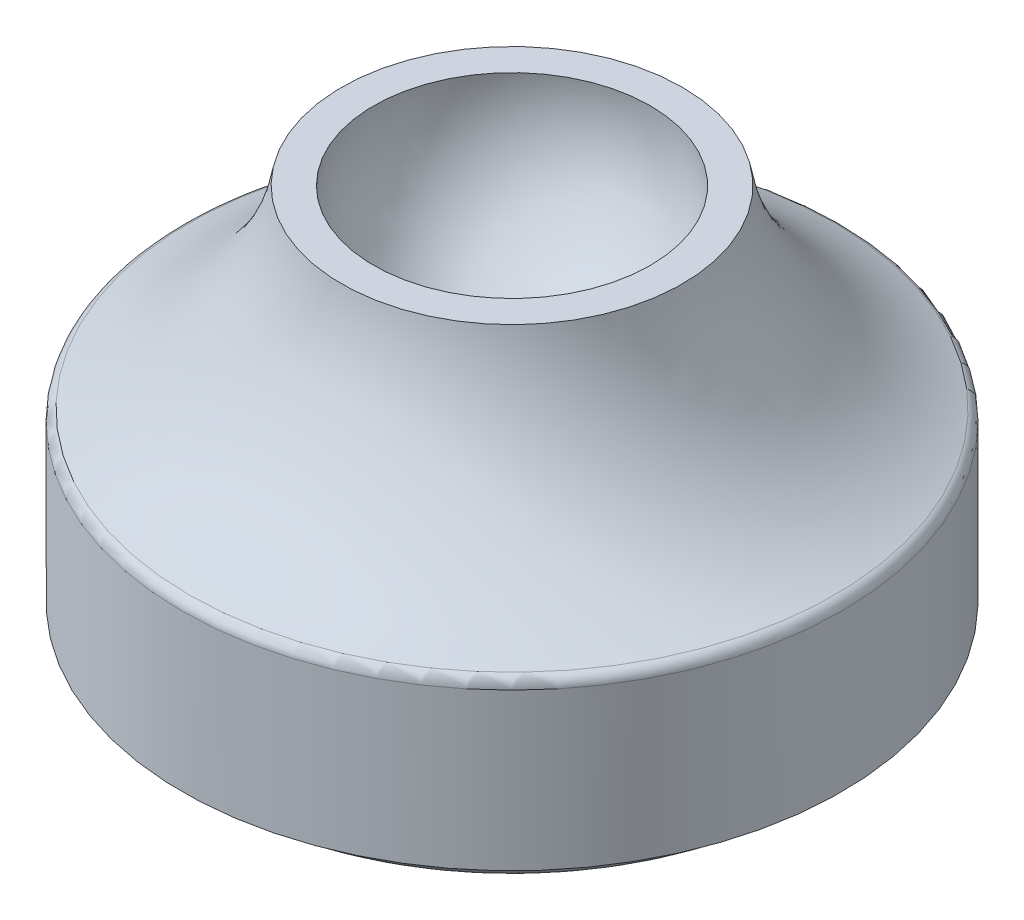
ISO-10303-21;
HEADER;
FILE_DESCRIPTION(('STEP AP214'),'2;1');
FILE_NAME('part.step','',(''),(''),'','','');
FILE_SCHEMA(('AUTOMOTIVE_DESIGN { 1 0 10303 214 1 1 1 1 }'));
ENDSEC;
DATA;
#1=APPLICATION_CONTEXT('core data for automotive mechanical design processes');
#2=APPLICATION_PROTOCOL_DEFINITION('international standard','automotive_design',2000,#1);
#3=PRODUCT_CONTEXT('',#1,'mechanical');
#4=PRODUCT('Part','Part','',(#3));
#5=PRODUCT_RELATED_PRODUCT_CATEGORY('part','',(#4));
#6=PRODUCT_DEFINITION_FORMATION('','',#4);
#7=PRODUCT_DEFINITION_CONTEXT('part definition',#1,'design');
#8=PRODUCT_DEFINITION('design','',#6,#7);
#9=PRODUCT_DEFINITION_SHAPE('','',#8);
#10=(LENGTH_UNIT() NAMED_UNIT(*) SI_UNIT(.MILLI.,.METRE.));
#11=(NAMED_UNIT(*) PLANE_ANGLE_UNIT() SI_UNIT($,.RADIAN.));
#12=(NAMED_UNIT(*) SI_UNIT($,.STERADIAN.) SOLID_ANGLE_UNIT());
#13=UNCERTAINTY_MEASURE_WITH_UNIT(LENGTH_MEASURE(1.E-05),#10,'distance_accuracy_value','');
#14=(GEOMETRIC_REPRESENTATION_CONTEXT(3) GLOBAL_UNCERTAINTY_ASSIGNED_CONTEXT((#13)) GLOBAL_UNIT_ASSIGNED_CONTEXT((#10,
#11,#12)) REPRESENTATION_CONTEXT('',''));
#15=CARTESIAN_POINT('',(0.,0.,0.));
#16=DIRECTION('',(0.,0.,1.));
#17=DIRECTION('',(1.,0.,0.));
#18=AXIS2_PLACEMENT_3D('',#15,#16,#17);
#19=CARTESIAN_POINT('',(0.,0.,0.));
#20=DIRECTION('',(0.,-1.,0.));
#21=DIRECTION('',(0.,0.,-1.));
#22=AXIS2_PLACEMENT_3D('',#19,#20,#21);
#23=PLANE('',#22);
#24=CARTESIAN_POINT('',(0.,0.,0.));
#25=DIRECTION('',(0.,-1.,0.));
#26=DIRECTION('',(0.,0.,-1.));
#27=AXIS2_PLACEMENT_3D('',#24,#25,#26);
#28=CIRCLE('',#27,25.2861999120616);
#29=CARTESIAN_POINT('',(0.,0.,-25.2861999120616));
#30=VERTEX_POINT('',#29);
#31=EDGE_CURVE('E48',#30,#30,#28,.T.);
#32=ORIENTED_EDGE('',*,*,#31,.T.);
#33=EDGE_LOOP('',(#32));
#34=FACE_BOUND('',#33,.T.);
#35=ADVANCED_FACE('F33',(#34),#23,.T.);
#36=CARTESIAN_POINT('',(0.,0.,0.));
#37=DIRECTION('',(0.,-1.,0.));
#38=DIRECTION('',(0.,0.,-1.));
#39=AXIS2_PLACEMENT_3D('',#36,#37,#38);
#40=CYLINDRICAL_SURFACE('',#39,26.2861999120616);
#41=CARTESIAN_POINT('',(0.,1.,0.));
#42=DIRECTION('',(0.,-1.,0.));
#43=DIRECTION('',(0.,0.,-1.));
#44=AXIS2_PLACEMENT_3D('',#41,#42,#43);
#45=CIRCLE('',#44,26.2861999120616);
#46=CARTESIAN_POINT('',(0.,1.,-26.2861999120616));
#47=VERTEX_POINT('',#46);
#48=EDGE_CURVE('E44',#47,#47,#45,.F.);
#49=ORIENTED_EDGE('',*,*,#48,.T.);
#50=EDGE_LOOP('',(#49));
#51=FACE_BOUND('',#50,.T.);
#52=CARTESIAN_POINT('',(0.,2.41011497286926,0.));
#53=DIRECTION('',(0.,-1.,0.));
#54=DIRECTION('',(0.,0.,-1.));
#55=AXIS2_PLACEMENT_3D('',#52,#53,#54);
#56=CIRCLE('',#55,26.2861999120616);
#57=CARTESIAN_POINT('',(0.,2.41011497286926,-26.2861999120616));
#58=VERTEX_POINT('',#57);
#59=EDGE_CURVE('E53',#58,#58,#56,.T.);
#60=ORIENTED_EDGE('',*,*,#59,.T.);
#61=EDGE_LOOP('',(#60));
#62=FACE_BOUND('',#61,.T.);
#63=ADVANCED_FACE('F81',(#51,#62),#40,.T.);
#64=CARTESIAN_POINT('',(26.2861999120616,2.41011497286926,0.));
#65=DIRECTION('',(0.,-1.,0.));
#66=DIRECTION('',(0.,0.,-1.));
#67=AXIS2_PLACEMENT_3D('',#64,#65,#66);
#68=PLANE('',#67);
#69=CARTESIAN_POINT('',(0.,2.41011497286926,0.));
#70=DIRECTION('',(0.,-1.,0.));
#71=DIRECTION('',(0.,0.,-1.));
#72=AXIS2_PLACEMENT_3D('',#69,#70,#71);
#73=CIRCLE('',#72,28.7352094385034);
#74=CARTESIAN_POINT('',(0.,2.41011497286926,-28.7352094385034));
#75=VERTEX_POINT('',#74);
#76=EDGE_CURVE('E56',#75,#75,#73,.T.);
#77=ORIENTED_EDGE('',*,*,#76,.T.);
#78=EDGE_LOOP('',(#77));
#79=FACE_BOUND('',#78,.T.);
#80=ORIENTED_EDGE('',*,*,#59,.F.);
#81=EDGE_LOOP('',(#80));
#82=FACE_BOUND('',#81,.T.);
#83=ADVANCED_FACE('F87',(#79,#82),#68,.T.);
#84=CARTESIAN_POINT('',(0.,0.,0.));
#85=DIRECTION('',(0.,-1.,0.));
#86=DIRECTION('',(0.,0.,-1.));
#87=AXIS2_PLACEMENT_3D('',#84,#85,#86);
#88=CYLINDRICAL_SURFACE('',#87,28.7352094385034);
#89=CARTESIAN_POINT('',(0.,16.0521315272081,0.));
#90=DIRECTION('',(0.,1.,0.));
#91=DIRECTION('',(0.,0.,1.));
#92=AXIS2_PLACEMENT_3D('',#89,#90,#91);
#93=CIRCLE('',#92,28.7352094385034);
#94=CARTESIAN_POINT('',(0.,16.0521315272081,28.7352094385034));
#95=VERTEX_POINT('',#94);
#96=EDGE_CURVE('E40',#95,#95,#93,.F.);
#97=ORIENTED_EDGE('',*,*,#96,.T.);
#98=EDGE_LOOP('',(#97));
#99=FACE_BOUND('',#98,.T.);
#100=ORIENTED_EDGE('',*,*,#76,.F.);
#101=EDGE_LOOP('',(#100));
#102=FACE_BOUND('',#101,.T.);
#103=ADVANCED_FACE('F93',(#99,#102),#88,.T.);
#104=CARTESIAN_POINT('',(0.,37.4038522132563,0.));
#105=DIRECTION('',(0.,-1.,0.));
#106=DIRECTION('',(0.,0.,-1.));
#107=AXIS2_PLACEMENT_3D('',#104,#105,#106);
#108=TOROIDAL_SURFACE('',#107,36.7437325717797,22.1743277205142);
#109=CARTESIAN_POINT('',(0.,16.9734838505011,0.));
#110=DIRECTION('',(0.,1.,0.));
#111=DIRECTION('',(0.,0.,1.));
#112=AXIS2_PLACEMENT_3D('',#109,#110,#111);
#113=CIRCLE('',#112,28.123938002366);
#114=CARTESIAN_POINT('',(0.,16.9734838505011,28.123938002366));
#115=VERTEX_POINT('',#114);
#116=EDGE_CURVE('E10',#115,#115,#113,.T.);
#117=ORIENTED_EDGE('',*,*,#116,.T.);
#118=EDGE_LOOP('',(#117));
#119=FACE_BOUND('',#118,.T.);
#120=CARTESIAN_POINT('',(0.,33.8411084780281,0.));
#121=DIRECTION('',(0.,-1.,0.));
#122=DIRECTION('',(0.,0.,-1.));
#123=AXIS2_PLACEMENT_3D('',#120,#121,#122);
#124=CIRCLE('',#123,14.8574887886667);
#125=CARTESIAN_POINT('',(0.,33.8411084780281,-14.8574887886667));
#126=VERTEX_POINT('',#125);
#127=EDGE_CURVE('E59',#126,#126,#124,.T.);
#128=ORIENTED_EDGE('',*,*,#127,.T.);
#129=EDGE_LOOP('',(#128));
#130=FACE_BOUND('',#129,.T.);
#131=ADVANCED_FACE('F78',(#119,#130),#108,.F.);
#132=CARTESIAN_POINT('',(14.8574887886667,33.8411084780281,0.));
#133=DIRECTION('',(0.,1.,0.));
#134=DIRECTION('',(0.,0.,1.));
#135=AXIS2_PLACEMENT_3D('',#132,#133,#134);
#136=PLANE('',#135);
#137=CARTESIAN_POINT('',(0.,33.8411084780281,0.));
#138=DIRECTION('',(0.,-1.,0.));
#139=DIRECTION('',(0.,0.,-1.));
#140=AXIS2_PLACEMENT_3D('',#137,#138,#139);
#141=CIRCLE('',#140,12.0635351707813);
#142=CARTESIAN_POINT('',(0.,33.8411084780281,-12.0635351707813));
#143=VERTEX_POINT('',#142);
#144=EDGE_CURVE('E62',#143,#143,#141,.T.);
#145=ORIENTED_EDGE('',*,*,#144,.T.);
#146=EDGE_LOOP('',(#145));
#147=FACE_BOUND('',#146,.T.);
#148=ORIENTED_EDGE('',*,*,#127,.F.);
#149=EDGE_LOOP('',(#148));
#150=FACE_BOUND('',#149,.T.);
#151=ADVANCED_FACE('F66',(#147,#150),#136,.T.);
#152=CARTESIAN_POINT('',(0.,32.2596918258742,0.));
#153=DIRECTION('',(0.,-1.,0.));
#154=DIRECTION('',(1.,0.,0.));
#155=AXIS2_PLACEMENT_3D('',#152,#153,#154);
#156=SPHERICAL_SURFACE('',#155,12.1667481047479);
#157=ORIENTED_EDGE('',*,*,#144,.F.);
#158=EDGE_LOOP('',(#157));
#159=FACE_BOUND('',#158,.T.);
#160=ADVANCED_FACE('F69',(#159),#156,.F.);
#161=CARTESIAN_POINT('',(0.,1.,0.));
#162=DIRECTION('',(0.,-1.,0.));
#163=DIRECTION('',(0.,0.,-1.));
#164=AXIS2_PLACEMENT_3D('',#161,#162,#163);
#165=TOROIDAL_SURFACE('',#164,25.2861999120616,1.);
#166=ORIENTED_EDGE('',*,*,#48,.F.);
#167=EDGE_LOOP('',(#166));
#168=FACE_BOUND('',#167,.T.);
#169=ORIENTED_EDGE('',*,*,#31,.F.);
#170=EDGE_LOOP('',(#169));
#171=FACE_BOUND('',#170,.T.);
#172=ADVANCED_FACE('F71',(#168,#171),#165,.T.);
#173=CARTESIAN_POINT('',(0.,16.0521315272081,0.));
#174=DIRECTION('',(0.,1.,0.));
#175=DIRECTION('',(0.,0.,1.));
#176=AXIS2_PLACEMENT_3D('',#173,#174,#175);
#177=TOROIDAL_SURFACE('',#176,27.7352094385034,1.);
#178=ORIENTED_EDGE('',*,*,#116,.F.);
#179=EDGE_LOOP('',(#178));
#180=FACE_BOUND('',#179,.T.);
#181=ORIENTED_EDGE('',*,*,#96,.F.);
#182=EDGE_LOOP('',(#181));
#183=FACE_BOUND('',#182,.T.);
#184=ADVANCED_FACE('F35',(#180,#183),#177,.T.);
#185=CLOSED_SHELL('',(#35,#63,#83,#103,#131,#151,#160,#172,#184));
#186=MANIFOLD_SOLID_BREP('B2',#185);
#187=ADVANCED_BREP_SHAPE_REPRESENTATION('',(#18,#186),#14);
#188=SHAPE_DEFINITION_REPRESENTATION(#9,#187);
ENDSEC;
END-ISO-10303-21;
